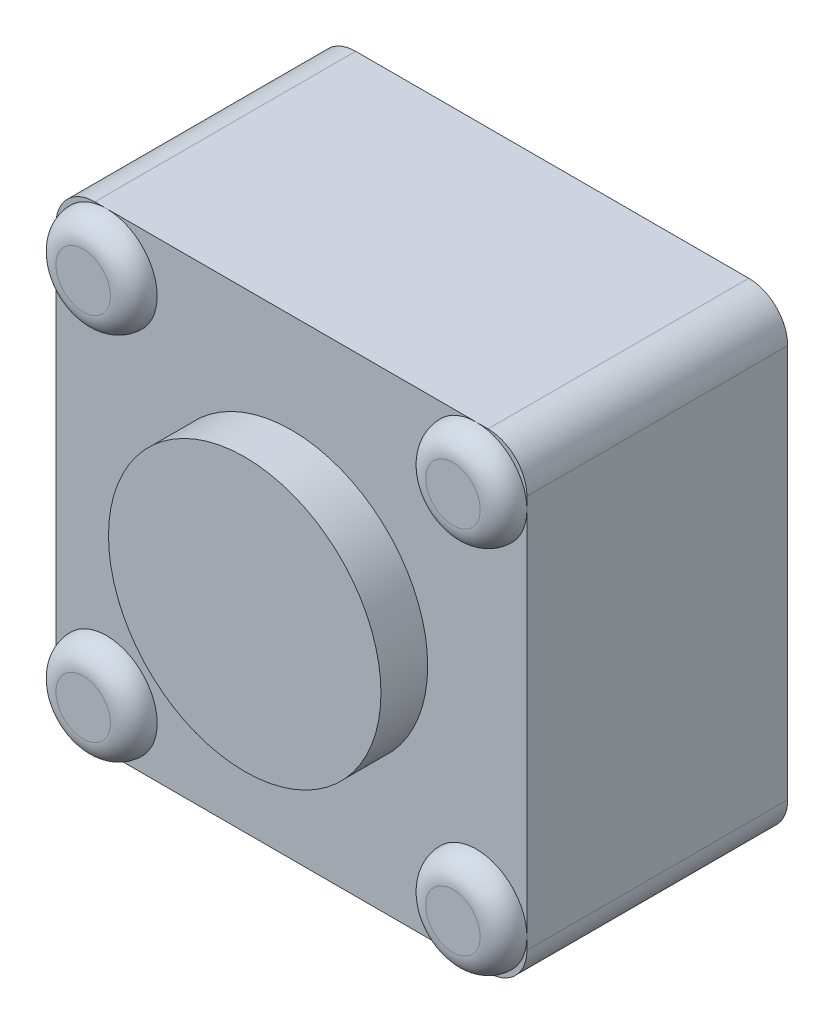
ISO-10303-21;
HEADER;
FILE_DESCRIPTION(('STEP AP214'),'2;1');
FILE_NAME('part.step','',(''),(''),'','','');
FILE_SCHEMA(('AUTOMOTIVE_DESIGN { 1 0 10303 214 1 1 1 1 }'));
ENDSEC;
DATA;
#1=APPLICATION_CONTEXT('core data for automotive mechanical design processes');
#2=APPLICATION_PROTOCOL_DEFINITION('international standard','automotive_design',2000,#1);
#3=PRODUCT_CONTEXT('',#1,'mechanical');
#4=PRODUCT('Part','Part','',(#3));
#5=PRODUCT_RELATED_PRODUCT_CATEGORY('part','',(#4));
#6=PRODUCT_DEFINITION_FORMATION('','',#4);
#7=PRODUCT_DEFINITION_CONTEXT('part definition',#1,'design');
#8=PRODUCT_DEFINITION('design','',#6,#7);
#9=PRODUCT_DEFINITION_SHAPE('','',#8);
#10=(LENGTH_UNIT() NAMED_UNIT(*) SI_UNIT(.MILLI.,.METRE.));
#11=(NAMED_UNIT(*) PLANE_ANGLE_UNIT() SI_UNIT($,.RADIAN.));
#12=(NAMED_UNIT(*) SI_UNIT($,.STERADIAN.) SOLID_ANGLE_UNIT());
#13=UNCERTAINTY_MEASURE_WITH_UNIT(LENGTH_MEASURE(1.E-05),#10,'distance_accuracy_value','');
#14=(GEOMETRIC_REPRESENTATION_CONTEXT(3) GLOBAL_UNCERTAINTY_ASSIGNED_CONTEXT((#13)) GLOBAL_UNIT_ASSIGNED_CONTEXT((#10,
#11,#12)) REPRESENTATION_CONTEXT('',''));
#15=CARTESIAN_POINT('',(0.,0.,0.));
#16=DIRECTION('',(0.,0.,1.));
#17=DIRECTION('',(1.,0.,0.));
#18=AXIS2_PLACEMENT_3D('',#15,#16,#17);
#19=CARTESIAN_POINT('',(-2.375,-2.375,3.65));
#20=DIRECTION('',(0.,0.,1.));
#21=DIRECTION('',(1.,0.,0.));
#22=AXIS2_PLACEMENT_3D('',#19,#20,#21);
#23=PLANE('',#22);
#24=CARTESIAN_POINT('',(-2.375,-2.375,3.65));
#25=DIRECTION('',(0.,0.,-1.));
#26=DIRECTION('',(1.,0.,0.));
#27=AXIS2_PLACEMENT_3D('',#24,#25,#26);
#28=CIRCLE('',#27,0.35);
#29=CARTESIAN_POINT('',(-2.025,-2.375,3.65));
#30=VERTEX_POINT('',#29);
#31=EDGE_CURVE('E257',#30,#30,#28,.T.);
#32=ORIENTED_EDGE('',*,*,#31,.F.);
#33=EDGE_LOOP('',(#32));
#34=FACE_BOUND('',#33,.T.);
#35=ADVANCED_FACE('F16',(#34),#23,.T.);
#36=CARTESIAN_POINT('',(2.375,-2.375,3.65));
#37=DIRECTION('',(0.,0.,1.));
#38=DIRECTION('',(1.,0.,0.));
#39=AXIS2_PLACEMENT_3D('',#36,#37,#38);
#40=PLANE('',#39);
#41=CARTESIAN_POINT('',(2.375,-2.375,3.65));
#42=DIRECTION('',(0.,0.,-1.));
#43=DIRECTION('',(1.,0.,0.));
#44=AXIS2_PLACEMENT_3D('',#41,#42,#43);
#45=CIRCLE('',#44,0.35);
#46=CARTESIAN_POINT('',(2.725,-2.375,3.65));
#47=VERTEX_POINT('',#46);
#48=EDGE_CURVE('E221',#47,#47,#45,.T.);
#49=ORIENTED_EDGE('',*,*,#48,.F.);
#50=EDGE_LOOP('',(#49));
#51=FACE_BOUND('',#50,.T.);
#52=ADVANCED_FACE('F201',(#51),#40,.T.);
#53=CARTESIAN_POINT('',(2.375,2.375,3.65));
#54=DIRECTION('',(0.,0.,1.));
#55=DIRECTION('',(1.,0.,0.));
#56=AXIS2_PLACEMENT_3D('',#53,#54,#55);
#57=PLANE('',#56);
#58=CARTESIAN_POINT('',(2.375,2.375,3.65));
#59=DIRECTION('',(0.,0.,-1.));
#60=DIRECTION('',(1.,0.,0.));
#61=AXIS2_PLACEMENT_3D('',#58,#59,#60);
#62=CIRCLE('',#61,0.35);
#63=CARTESIAN_POINT('',(2.725,2.375,3.65));
#64=VERTEX_POINT('',#63);
#65=EDGE_CURVE('E185',#64,#64,#62,.T.);
#66=ORIENTED_EDGE('',*,*,#65,.F.);
#67=EDGE_LOOP('',(#66));
#68=FACE_BOUND('',#67,.T.);
#69=ADVANCED_FACE('F191',(#68),#57,.T.);
#70=CARTESIAN_POINT('',(-2.375,2.375,3.65));
#71=DIRECTION('',(0.,0.,1.));
#72=DIRECTION('',(1.,0.,0.));
#73=AXIS2_PLACEMENT_3D('',#70,#71,#72);
#74=PLANE('',#73);
#75=CARTESIAN_POINT('',(-2.375,2.375,3.65));
#76=DIRECTION('',(0.,0.,-1.));
#77=DIRECTION('',(1.,0.,0.));
#78=AXIS2_PLACEMENT_3D('',#75,#76,#77);
#79=CIRCLE('',#78,0.35);
#80=CARTESIAN_POINT('',(-2.025,2.375,3.65));
#81=VERTEX_POINT('',#80);
#82=EDGE_CURVE('E243',#81,#81,#79,.T.);
#83=ORIENTED_EDGE('',*,*,#82,.F.);
#84=EDGE_LOOP('',(#83));
#85=FACE_BOUND('',#84,.T.);
#86=ADVANCED_FACE('F200',(#85),#74,.T.);
#87=CARTESIAN_POINT('',(0.,0.,3.95));
#88=DIRECTION('',(0.,0.,1.));
#89=DIRECTION('',(1.,0.,0.));
#90=AXIS2_PLACEMENT_3D('',#87,#88,#89);
#91=PLANE('',#90);
#92=CARTESIAN_POINT('',(0.,0.,3.95));
#93=DIRECTION('',(0.,0.,1.));
#94=DIRECTION('',(1.,0.,0.));
#95=AXIS2_PLACEMENT_3D('',#92,#93,#94);
#96=CIRCLE('',#95,1.75);
#97=CARTESIAN_POINT('',(1.75,0.,3.95));
#98=VERTEX_POINT('',#97);
#99=EDGE_CURVE('E251',#98,#98,#96,.F.);
#100=ORIENTED_EDGE('',*,*,#99,.F.);
#101=EDGE_LOOP('',(#100));
#102=FACE_BOUND('',#101,.T.);
#103=ADVANCED_FACE('F507',(#102),#91,.T.);
#104=CARTESIAN_POINT('',(-2.375,-2.375,3.35));
#105=DIRECTION('',(0.,0.,1.));
#106=DIRECTION('',(1.,0.,0.));
#107=AXIS2_PLACEMENT_3D('',#104,#105,#106);
#108=TOROIDAL_SURFACE('',#107,0.35,0.3);
#109=ORIENTED_EDGE('',*,*,#31,.T.);
#110=EDGE_LOOP('',(#109));
#111=FACE_BOUND('',#110,.T.);
#112=CARTESIAN_POINT('',(-2.375,-2.375,3.35));
#113=DIRECTION('',(0.,0.,1.));
#114=DIRECTION('',(1.,0.,0.));
#115=AXIS2_PLACEMENT_3D('',#112,#113,#114);
#116=CIRCLE('',#115,0.65);
#117=CARTESIAN_POINT('',(-3.025,-2.375,3.35));
#118=VERTEX_POINT('',#117);
#119=CARTESIAN_POINT('',(-2.375,-3.025,3.35));
#120=VERTEX_POINT('',#119);
#121=EDGE_CURVE('E111',#118,#120,#116,.F.);
#122=ORIENTED_EDGE('',*,*,#121,.F.);
#123=CARTESIAN_POINT('',(-2.375,-2.375,3.35));
#124=DIRECTION('',(0.,0.,1.));
#125=DIRECTION('',(1.,0.,0.));
#126=AXIS2_PLACEMENT_3D('',#123,#124,#125);
#127=CIRCLE('',#126,0.65);
#128=EDGE_CURVE('E136',#120,#118,#127,.F.);
#129=ORIENTED_EDGE('',*,*,#128,.F.);
#130=EDGE_LOOP('',(#122,#129));
#131=FACE_BOUND('',#130,.T.);
#132=ADVANCED_FACE('F137',(#111,#131),#108,.T.);
#133=CARTESIAN_POINT('',(2.375,-2.375,3.35));
#134=DIRECTION('',(0.,0.,1.));
#135=DIRECTION('',(1.,0.,0.));
#136=AXIS2_PLACEMENT_3D('',#133,#134,#135);
#137=TOROIDAL_SURFACE('',#136,0.35,0.3);
#138=ORIENTED_EDGE('',*,*,#48,.T.);
#139=EDGE_LOOP('',(#138));
#140=FACE_BOUND('',#139,.T.);
#141=CARTESIAN_POINT('',(2.375,-2.375,3.35));
#142=DIRECTION('',(0.,0.,1.));
#143=DIRECTION('',(1.,0.,0.));
#144=AXIS2_PLACEMENT_3D('',#141,#142,#143);
#145=CIRCLE('',#144,0.65);
#146=CARTESIAN_POINT('',(2.375,-3.025,3.35));
#147=VERTEX_POINT('',#146);
#148=CARTESIAN_POINT('',(3.025,-2.375,3.35));
#149=VERTEX_POINT('',#148);
#150=EDGE_CURVE('E120',#147,#149,#145,.F.);
#151=ORIENTED_EDGE('',*,*,#150,.F.);
#152=CARTESIAN_POINT('',(2.375,-2.375,3.35));
#153=DIRECTION('',(0.,0.,1.));
#154=DIRECTION('',(1.,0.,0.));
#155=AXIS2_PLACEMENT_3D('',#152,#153,#154);
#156=CIRCLE('',#155,0.65);
#157=EDGE_CURVE('E295',#149,#147,#156,.F.);
#158=ORIENTED_EDGE('',*,*,#157,.F.);
#159=EDGE_LOOP('',(#151,#158));
#160=FACE_BOUND('',#159,.T.);
#161=ADVANCED_FACE('F227',(#140,#160),#137,.T.);
#162=CARTESIAN_POINT('',(2.375,2.375,3.35));
#163=DIRECTION('',(0.,0.,1.));
#164=DIRECTION('',(1.,0.,0.));
#165=AXIS2_PLACEMENT_3D('',#162,#163,#164);
#166=TOROIDAL_SURFACE('',#165,0.35,0.3);
#167=ORIENTED_EDGE('',*,*,#65,.T.);
#168=EDGE_LOOP('',(#167));
#169=FACE_BOUND('',#168,.T.);
#170=CARTESIAN_POINT('',(2.375,2.375,3.35));
#171=DIRECTION('',(0.,0.,1.));
#172=DIRECTION('',(1.,0.,0.));
#173=AXIS2_PLACEMENT_3D('',#170,#171,#172);
#174=CIRCLE('',#173,0.65);
#175=CARTESIAN_POINT('',(2.375,3.025,3.35));
#176=VERTEX_POINT('',#175);
#177=CARTESIAN_POINT('',(3.025,2.375,3.35));
#178=VERTEX_POINT('',#177);
#179=EDGE_CURVE('E289',#176,#178,#174,.F.);
#180=ORIENTED_EDGE('',*,*,#179,.F.);
#181=CARTESIAN_POINT('',(2.375,2.375,3.35));
#182=DIRECTION('',(0.,0.,1.));
#183=DIRECTION('',(1.,0.,0.));
#184=AXIS2_PLACEMENT_3D('',#181,#182,#183);
#185=CIRCLE('',#184,0.65);
#186=EDGE_CURVE('E282',#178,#176,#185,.F.);
#187=ORIENTED_EDGE('',*,*,#186,.F.);
#188=EDGE_LOOP('',(#180,#187));
#189=FACE_BOUND('',#188,.T.);
#190=ADVANCED_FACE('F164',(#169,#189),#166,.T.);
#191=CARTESIAN_POINT('',(-2.375,2.375,3.35));
#192=DIRECTION('',(0.,0.,1.));
#193=DIRECTION('',(1.,0.,0.));
#194=AXIS2_PLACEMENT_3D('',#191,#192,#193);
#195=TOROIDAL_SURFACE('',#194,0.35,0.3);
#196=ORIENTED_EDGE('',*,*,#82,.T.);
#197=EDGE_LOOP('',(#196));
#198=FACE_BOUND('',#197,.T.);
#199=CARTESIAN_POINT('',(-2.375,2.375,3.35));
#200=DIRECTION('',(0.,0.,1.));
#201=DIRECTION('',(1.,0.,0.));
#202=AXIS2_PLACEMENT_3D('',#199,#200,#201);
#203=CIRCLE('',#202,0.65);
#204=CARTESIAN_POINT('',(-2.375,3.025,3.35));
#205=VERTEX_POINT('',#204);
#206=CARTESIAN_POINT('',(-3.025,2.375,3.35));
#207=VERTEX_POINT('',#206);
#208=EDGE_CURVE('E280',#205,#207,#203,.F.);
#209=ORIENTED_EDGE('',*,*,#208,.F.);
#210=CARTESIAN_POINT('',(-2.375,2.375,3.35));
#211=DIRECTION('',(0.,0.,1.));
#212=DIRECTION('',(1.,0.,0.));
#213=AXIS2_PLACEMENT_3D('',#210,#211,#212);
#214=CIRCLE('',#213,0.65);
#215=EDGE_CURVE('E20',#205,#207,#214,.T.);
#216=ORIENTED_EDGE('',*,*,#215,.T.);
#217=EDGE_LOOP('',(#209,#216));
#218=FACE_BOUND('',#217,.T.);
#219=ADVANCED_FACE('F158',(#198,#218),#195,.T.);
#220=CARTESIAN_POINT('',(0.,0.,3.35));
#221=DIRECTION('',(0.,0.,1.));
#222=DIRECTION('',(1.,0.,0.));
#223=AXIS2_PLACEMENT_3D('',#220,#221,#222);
#224=CYLINDRICAL_SURFACE('',#223,1.75);
#225=CARTESIAN_POINT('',(0.,0.,3.35));
#226=DIRECTION('',(0.,0.,1.));
#227=DIRECTION('',(1.,0.,0.));
#228=AXIS2_PLACEMENT_3D('',#225,#226,#227);
#229=CIRCLE('',#228,1.75);
#230=CARTESIAN_POINT('',(1.75,0.,3.35));
#231=VERTEX_POINT('',#230);
#232=EDGE_CURVE('E277',#231,#231,#229,.F.);
#233=ORIENTED_EDGE('',*,*,#232,.F.);
#234=EDGE_LOOP('',(#233));
#235=FACE_BOUND('',#234,.T.);
#236=ORIENTED_EDGE('',*,*,#99,.T.);
#237=EDGE_LOOP('',(#236));
#238=FACE_BOUND('',#237,.T.);
#239=ADVANCED_FACE('F163',(#235,#238),#224,.T.);
#240=CARTESIAN_POINT('',(2.525,-2.525,0.));
#241=DIRECTION('',(0.,0.,1.));
#242=DIRECTION('',(1.,0.,0.));
#243=AXIS2_PLACEMENT_3D('',#240,#241,#242);
#244=CYLINDRICAL_SURFACE('',#243,0.5);
#245=CARTESIAN_POINT('',(2.525,-2.525,0.));
#246=DIRECTION('',(0.,0.,1.));
#247=DIRECTION('',(1.,0.,0.));
#248=AXIS2_PLACEMENT_3D('',#245,#246,#247);
#249=CIRCLE('',#248,0.5);
#250=CARTESIAN_POINT('',(2.525,-3.025,0.));
#251=VERTEX_POINT('',#250);
#252=CARTESIAN_POINT('',(3.025,-2.525,0.));
#253=VERTEX_POINT('',#252);
#254=EDGE_CURVE('E253',#251,#253,#249,.T.);
#255=ORIENTED_EDGE('',*,*,#254,.T.);
#256=DIRECTION('',(0.,0.,-1.));
#257=VECTOR('',#256,1.);
#258=CARTESIAN_POINT('',(3.025,-2.525,0.));
#259=LINE('',#258,#257);
#260=CARTESIAN_POINT('',(3.025,-2.525,3.35));
#261=VERTEX_POINT('',#260);
#262=EDGE_CURVE('E144',#261,#253,#259,.T.);
#263=ORIENTED_EDGE('',*,*,#262,.F.);
#264=CARTESIAN_POINT('',(2.525,-2.525,3.35));
#265=DIRECTION('',(0.,0.,1.));
#266=DIRECTION('',(1.,0.,0.));
#267=AXIS2_PLACEMENT_3D('',#264,#265,#266);
#268=CIRCLE('',#267,0.5);
#269=CARTESIAN_POINT('',(2.525,-3.025,3.35));
#270=VERTEX_POINT('',#269);
#271=EDGE_CURVE('E293',#270,#261,#268,.T.);
#272=ORIENTED_EDGE('',*,*,#271,.F.);
#273=DIRECTION('',(0.,0.,-1.));
#274=VECTOR('',#273,1.);
#275=CARTESIAN_POINT('',(2.525,-3.025,0.));
#276=LINE('',#275,#274);
#277=EDGE_CURVE('E152',#251,#270,#276,.F.);
#278=ORIENTED_EDGE('',*,*,#277,.F.);
#279=EDGE_LOOP('',(#255,#263,#272,#278));
#280=FACE_BOUND('',#279,.T.);
#281=ADVANCED_FACE('F300',(#280),#244,.T.);
#282=CARTESIAN_POINT('',(0.,0.,3.35));
#283=DIRECTION('',(0.,0.,1.));
#284=DIRECTION('',(1.,0.,0.));
#285=AXIS2_PLACEMENT_3D('',#282,#283,#284);
#286=PLANE('',#285);
#287=ORIENTED_EDGE('',*,*,#271,.T.);
#288=DIRECTION('',(0.,1.,0.));
#289=VECTOR('',#288,1.);
#290=CARTESIAN_POINT('',(3.025,-3.025,3.35));
#291=LINE('',#290,#289);
#292=EDGE_CURVE('E311',#149,#261,#291,.F.);
#293=ORIENTED_EDGE('',*,*,#292,.F.);
#294=ORIENTED_EDGE('',*,*,#157,.T.);
#295=DIRECTION('',(1.,0.,0.));
#296=VECTOR('',#295,1.);
#297=CARTESIAN_POINT('',(-3.025,-3.025,3.35));
#298=LINE('',#297,#296);
#299=EDGE_CURVE('E132',#270,#147,#298,.F.);
#300=ORIENTED_EDGE('',*,*,#299,.F.);
#301=EDGE_LOOP('',(#287,#293,#294,#300));
#302=FACE_BOUND('',#301,.T.);
#303=ADVANCED_FACE('F364',(#302),#286,.T.);
#304=CARTESIAN_POINT('',(2.525,2.525,0.));
#305=DIRECTION('',(0.,0.,1.));
#306=DIRECTION('',(1.,0.,0.));
#307=AXIS2_PLACEMENT_3D('',#304,#305,#306);
#308=CYLINDRICAL_SURFACE('',#307,0.5);
#309=CARTESIAN_POINT('',(2.525,2.525,0.));
#310=DIRECTION('',(0.,0.,1.));
#311=DIRECTION('',(1.,0.,0.));
#312=AXIS2_PLACEMENT_3D('',#309,#310,#311);
#313=CIRCLE('',#312,0.5);
#314=CARTESIAN_POINT('',(3.025,2.525,0.));
#315=VERTEX_POINT('',#314);
#316=CARTESIAN_POINT('',(2.525,3.025,0.));
#317=VERTEX_POINT('',#316);
#318=EDGE_CURVE('E291',#315,#317,#313,.T.);
#319=ORIENTED_EDGE('',*,*,#318,.T.);
#320=DIRECTION('',(0.,0.,1.));
#321=VECTOR('',#320,1.);
#322=CARTESIAN_POINT('',(2.525,3.025,0.));
#323=LINE('',#322,#321);
#324=CARTESIAN_POINT('',(2.525,3.025,3.35));
#325=VERTEX_POINT('',#324);
#326=EDGE_CURVE('E329',#325,#317,#323,.F.);
#327=ORIENTED_EDGE('',*,*,#326,.F.);
#328=CARTESIAN_POINT('',(2.525,2.525,3.35));
#329=DIRECTION('',(0.,0.,1.));
#330=DIRECTION('',(1.,0.,0.));
#331=AXIS2_PLACEMENT_3D('',#328,#329,#330);
#332=CIRCLE('',#331,0.5);
#333=CARTESIAN_POINT('',(3.025,2.525,3.35));
#334=VERTEX_POINT('',#333);
#335=EDGE_CURVE('E287',#334,#325,#332,.T.);
#336=ORIENTED_EDGE('',*,*,#335,.F.);
#337=DIRECTION('',(0.,0.,-1.));
#338=VECTOR('',#337,1.);
#339=CARTESIAN_POINT('',(3.025,2.525,0.));
#340=LINE('',#339,#338);
#341=EDGE_CURVE('E147',#315,#334,#340,.F.);
#342=ORIENTED_EDGE('',*,*,#341,.F.);
#343=EDGE_LOOP('',(#319,#327,#336,#342));
#344=FACE_BOUND('',#343,.T.);
#345=ADVANCED_FACE('F366',(#344),#308,.T.);
#346=CARTESIAN_POINT('',(0.,0.,3.35));
#347=DIRECTION('',(0.,0.,1.));
#348=DIRECTION('',(1.,0.,0.));
#349=AXIS2_PLACEMENT_3D('',#346,#347,#348);
#350=PLANE('',#349);
#351=ORIENTED_EDGE('',*,*,#335,.T.);
#352=DIRECTION('',(1.,0.,0.));
#353=VECTOR('',#352,1.);
#354=CARTESIAN_POINT('',(3.025,3.025,3.35));
#355=LINE('',#354,#353);
#356=EDGE_CURVE('E328',#176,#325,#355,.T.);
#357=ORIENTED_EDGE('',*,*,#356,.F.);
#358=ORIENTED_EDGE('',*,*,#179,.T.);
#359=DIRECTION('',(0.,1.,0.));
#360=VECTOR('',#359,1.);
#361=CARTESIAN_POINT('',(3.025,-3.025,3.35));
#362=LINE('',#361,#360);
#363=EDGE_CURVE('E336',#334,#178,#362,.F.);
#364=ORIENTED_EDGE('',*,*,#363,.F.);
#365=EDGE_LOOP('',(#351,#357,#358,#364));
#366=FACE_BOUND('',#365,.T.);
#367=ADVANCED_FACE('F373',(#366),#350,.T.);
#368=CARTESIAN_POINT('',(-2.525,-2.525,0.));
#369=DIRECTION('',(0.,0.,1.));
#370=DIRECTION('',(1.,0.,0.));
#371=AXIS2_PLACEMENT_3D('',#368,#369,#370);
#372=CYLINDRICAL_SURFACE('',#371,0.5);
#373=CARTESIAN_POINT('',(-2.525,-2.525,0.));
#374=DIRECTION('',(0.,0.,1.));
#375=DIRECTION('',(1.,0.,0.));
#376=AXIS2_PLACEMENT_3D('',#373,#374,#375);
#377=CIRCLE('',#376,0.5);
#378=CARTESIAN_POINT('',(-3.025,-2.525,0.));
#379=VERTEX_POINT('',#378);
#380=CARTESIAN_POINT('',(-2.525,-3.025,0.));
#381=VERTEX_POINT('',#380);
#382=EDGE_CURVE('E35',#379,#381,#377,.T.);
#383=ORIENTED_EDGE('',*,*,#382,.T.);
#384=DIRECTION('',(0.,0.,-1.));
#385=VECTOR('',#384,1.);
#386=CARTESIAN_POINT('',(-2.525,-3.025,0.));
#387=LINE('',#386,#385);
#388=CARTESIAN_POINT('',(-2.525,-3.025,3.35));
#389=VERTEX_POINT('',#388);
#390=EDGE_CURVE('E275',#389,#381,#387,.T.);
#391=ORIENTED_EDGE('',*,*,#390,.F.);
#392=CARTESIAN_POINT('',(-2.525,-2.525,3.35));
#393=DIRECTION('',(0.,0.,1.));
#394=DIRECTION('',(1.,0.,0.));
#395=AXIS2_PLACEMENT_3D('',#392,#393,#394);
#396=CIRCLE('',#395,0.5);
#397=CARTESIAN_POINT('',(-3.025,-2.525,3.35));
#398=VERTEX_POINT('',#397);
#399=EDGE_CURVE('E121',#398,#389,#396,.T.);
#400=ORIENTED_EDGE('',*,*,#399,.F.);
#401=DIRECTION('',(0.,0.,1.));
#402=VECTOR('',#401,1.);
#403=CARTESIAN_POINT('',(-3.025,-2.525,0.));
#404=LINE('',#403,#402);
#405=EDGE_CURVE('E325',#379,#398,#404,.T.);
#406=ORIENTED_EDGE('',*,*,#405,.F.);
#407=EDGE_LOOP('',(#383,#391,#400,#406));
#408=FACE_BOUND('',#407,.T.);
#409=ADVANCED_FACE('F404',(#408),#372,.T.);
#410=CARTESIAN_POINT('',(0.,0.,3.35));
#411=DIRECTION('',(0.,0.,1.));
#412=DIRECTION('',(1.,0.,0.));
#413=AXIS2_PLACEMENT_3D('',#410,#411,#412);
#414=PLANE('',#413);
#415=ORIENTED_EDGE('',*,*,#399,.T.);
#416=DIRECTION('',(1.,0.,0.));
#417=VECTOR('',#416,1.);
#418=CARTESIAN_POINT('',(-3.025,-3.025,3.35));
#419=LINE('',#418,#417);
#420=EDGE_CURVE('E129',#120,#389,#419,.F.);
#421=ORIENTED_EDGE('',*,*,#420,.F.);
#422=ORIENTED_EDGE('',*,*,#128,.T.);
#423=DIRECTION('',(0.,1.,0.));
#424=VECTOR('',#423,1.);
#425=CARTESIAN_POINT('',(-3.025,3.025,3.35));
#426=LINE('',#425,#424);
#427=EDGE_CURVE('E327',#398,#118,#426,.T.);
#428=ORIENTED_EDGE('',*,*,#427,.F.);
#429=EDGE_LOOP('',(#415,#421,#422,#428));
#430=FACE_BOUND('',#429,.T.);
#431=ADVANCED_FACE('F142',(#430),#414,.T.);
#432=CARTESIAN_POINT('',(0.,0.,3.35));
#433=DIRECTION('',(0.,0.,1.));
#434=DIRECTION('',(1.,0.,0.));
#435=AXIS2_PLACEMENT_3D('',#432,#433,#434);
#436=PLANE('',#435);
#437=ORIENTED_EDGE('',*,*,#232,.T.);
#438=EDGE_LOOP('',(#437));
#439=FACE_BOUND('',#438,.T.);
#440=ORIENTED_EDGE('',*,*,#208,.T.);
#441=DIRECTION('',(0.,1.,0.));
#442=VECTOR('',#441,1.);
#443=CARTESIAN_POINT('',(-3.025,3.025,3.35));
#444=LINE('',#443,#442);
#445=EDGE_CURVE('E117',#118,#207,#444,.T.);
#446=ORIENTED_EDGE('',*,*,#445,.F.);
#447=ORIENTED_EDGE('',*,*,#121,.T.);
#448=DIRECTION('',(1.,0.,0.));
#449=VECTOR('',#448,1.);
#450=CARTESIAN_POINT('',(-3.025,-3.025,3.35));
#451=LINE('',#450,#449);
#452=EDGE_CURVE('E115',#147,#120,#451,.F.);
#453=ORIENTED_EDGE('',*,*,#452,.F.);
#454=ORIENTED_EDGE('',*,*,#150,.T.);
#455=DIRECTION('',(0.,1.,0.));
#456=VECTOR('',#455,1.);
#457=CARTESIAN_POINT('',(3.025,-3.025,3.35));
#458=LINE('',#457,#456);
#459=EDGE_CURVE('E349',#178,#149,#458,.F.);
#460=ORIENTED_EDGE('',*,*,#459,.F.);
#461=ORIENTED_EDGE('',*,*,#186,.T.);
#462=DIRECTION('',(1.,0.,0.));
#463=VECTOR('',#462,1.);
#464=CARTESIAN_POINT('',(3.025,3.025,3.35));
#465=LINE('',#464,#463);
#466=EDGE_CURVE('E343',#205,#176,#465,.T.);
#467=ORIENTED_EDGE('',*,*,#466,.F.);
#468=EDGE_LOOP('',(#440,#446,#447,#453,#454,#460,#461,#467));
#469=FACE_BOUND('',#468,.T.);
#470=ADVANCED_FACE('F114',(#439,#469),#436,.T.);
#471=CARTESIAN_POINT('',(0.,0.,3.35));
#472=DIRECTION('',(0.,0.,1.));
#473=DIRECTION('',(1.,0.,0.));
#474=AXIS2_PLACEMENT_3D('',#471,#472,#473);
#475=PLANE('',#474);
#476=CARTESIAN_POINT('',(-2.525,2.525,3.35));
#477=DIRECTION('',(0.,0.,1.));
#478=DIRECTION('',(1.,0.,0.));
#479=AXIS2_PLACEMENT_3D('',#476,#477,#478);
#480=CIRCLE('',#479,0.5);
#481=CARTESIAN_POINT('',(-3.025,2.525,3.35));
#482=VERTEX_POINT('',#481);
#483=CARTESIAN_POINT('',(-2.525,3.025,3.35));
#484=VERTEX_POINT('',#483);
#485=EDGE_CURVE('E99',#482,#484,#480,.F.);
#486=ORIENTED_EDGE('',*,*,#485,.F.);
#487=DIRECTION('',(0.,1.,0.));
#488=VECTOR('',#487,1.);
#489=CARTESIAN_POINT('',(-3.025,3.025,3.35));
#490=LINE('',#489,#488);
#491=EDGE_CURVE('E324',#207,#482,#490,.T.);
#492=ORIENTED_EDGE('',*,*,#491,.F.);
#493=ORIENTED_EDGE('',*,*,#215,.F.);
#494=DIRECTION('',(1.,0.,0.));
#495=VECTOR('',#494,1.);
#496=CARTESIAN_POINT('',(3.025,3.025,3.35));
#497=LINE('',#496,#495);
#498=EDGE_CURVE('E333',#484,#205,#497,.T.);
#499=ORIENTED_EDGE('',*,*,#498,.F.);
#500=EDGE_LOOP('',(#486,#492,#493,#499));
#501=FACE_BOUND('',#500,.T.);
#502=ADVANCED_FACE('F396',(#501),#475,.T.);
#503=CARTESIAN_POINT('',(-2.525,2.525,0.));
#504=DIRECTION('',(0.,0.,1.));
#505=DIRECTION('',(1.,0.,0.));
#506=AXIS2_PLACEMENT_3D('',#503,#504,#505);
#507=CYLINDRICAL_SURFACE('',#506,0.5);
#508=CARTESIAN_POINT('',(-2.525,2.525,0.));
#509=DIRECTION('',(0.,0.,1.));
#510=DIRECTION('',(1.,0.,0.));
#511=AXIS2_PLACEMENT_3D('',#508,#509,#510);
#512=CIRCLE('',#511,0.5);
#513=CARTESIAN_POINT('',(-2.525,3.025,0.));
#514=VERTEX_POINT('',#513);
#515=CARTESIAN_POINT('',(-3.025,2.525,0.));
#516=VERTEX_POINT('',#515);
#517=EDGE_CURVE('E268',#514,#516,#512,.T.);
#518=ORIENTED_EDGE('',*,*,#517,.T.);
#519=DIRECTION('',(0.,0.,1.));
#520=VECTOR('',#519,1.);
#521=CARTESIAN_POINT('',(-3.025,2.525,0.));
#522=LINE('',#521,#520);
#523=EDGE_CURVE('E319',#482,#516,#522,.F.);
#524=ORIENTED_EDGE('',*,*,#523,.F.);
#525=ORIENTED_EDGE('',*,*,#485,.T.);
#526=DIRECTION('',(0.,0.,1.));
#527=VECTOR('',#526,1.);
#528=CARTESIAN_POINT('',(-2.525,3.025,0.));
#529=LINE('',#528,#527);
#530=EDGE_CURVE('E332',#514,#484,#529,.T.);
#531=ORIENTED_EDGE('',*,*,#530,.F.);
#532=EDGE_LOOP('',(#518,#524,#525,#531));
#533=FACE_BOUND('',#532,.T.);
#534=ADVANCED_FACE('F393',(#533),#507,.T.);
#535=CARTESIAN_POINT('',(-3.025,-3.025,0.));
#536=DIRECTION('',(0.,-1.,0.));
#537=DIRECTION('',(0.,0.,-1.));
#538=AXIS2_PLACEMENT_3D('',#535,#536,#537);
#539=PLANE('',#538);
#540=ORIENTED_EDGE('',*,*,#452,.T.);
#541=ORIENTED_EDGE('',*,*,#420,.T.);
#542=ORIENTED_EDGE('',*,*,#390,.T.);
#543=DIRECTION('',(1.,0.,0.));
#544=VECTOR('',#543,1.);
#545=CARTESIAN_POINT('',(0.,-3.025,0.));
#546=LINE('',#545,#544);
#547=EDGE_CURVE('E315',#381,#251,#546,.T.);
#548=ORIENTED_EDGE('',*,*,#547,.T.);
#549=ORIENTED_EDGE('',*,*,#277,.T.);
#550=ORIENTED_EDGE('',*,*,#299,.T.);
#551=EDGE_LOOP('',(#540,#541,#542,#548,#549,#550));
#552=FACE_BOUND('',#551,.T.);
#553=ADVANCED_FACE('F126',(#552),#539,.T.);
#554=CARTESIAN_POINT('',(3.025,-3.025,0.));
#555=DIRECTION('',(1.,0.,0.));
#556=DIRECTION('',(0.,0.,-1.));
#557=AXIS2_PLACEMENT_3D('',#554,#555,#556);
#558=PLANE('',#557);
#559=ORIENTED_EDGE('',*,*,#459,.T.);
#560=ORIENTED_EDGE('',*,*,#292,.T.);
#561=ORIENTED_EDGE('',*,*,#262,.T.);
#562=DIRECTION('',(0.,1.,0.));
#563=VECTOR('',#562,1.);
#564=CARTESIAN_POINT('',(3.025,0.,0.));
#565=LINE('',#564,#563);
#566=EDGE_CURVE('E309',#253,#315,#565,.T.);
#567=ORIENTED_EDGE('',*,*,#566,.T.);
#568=ORIENTED_EDGE('',*,*,#341,.T.);
#569=ORIENTED_EDGE('',*,*,#363,.T.);
#570=EDGE_LOOP('',(#559,#560,#561,#567,#568,#569));
#571=FACE_BOUND('',#570,.T.);
#572=ADVANCED_FACE('F308',(#571),#558,.T.);
#573=CARTESIAN_POINT('',(3.025,3.025,0.));
#574=DIRECTION('',(0.,1.,0.));
#575=DIRECTION('',(0.,0.,1.));
#576=AXIS2_PLACEMENT_3D('',#573,#574,#575);
#577=PLANE('',#576);
#578=ORIENTED_EDGE('',*,*,#466,.T.);
#579=ORIENTED_EDGE('',*,*,#356,.T.);
#580=ORIENTED_EDGE('',*,*,#326,.T.);
#581=DIRECTION('',(1.,0.,0.));
#582=VECTOR('',#581,1.);
#583=CARTESIAN_POINT('',(0.,3.025,0.));
#584=LINE('',#583,#582);
#585=EDGE_CURVE('E26',#317,#514,#584,.F.);
#586=ORIENTED_EDGE('',*,*,#585,.T.);
#587=ORIENTED_EDGE('',*,*,#530,.T.);
#588=ORIENTED_EDGE('',*,*,#498,.T.);
#589=EDGE_LOOP('',(#578,#579,#580,#586,#587,#588));
#590=FACE_BOUND('',#589,.T.);
#591=ADVANCED_FACE('F382',(#590),#577,.T.);
#592=CARTESIAN_POINT('',(-3.025,3.025,0.));
#593=DIRECTION('',(-1.,0.,0.));
#594=DIRECTION('',(0.,0.,1.));
#595=AXIS2_PLACEMENT_3D('',#592,#593,#594);
#596=PLANE('',#595);
#597=ORIENTED_EDGE('',*,*,#523,.T.);
#598=DIRECTION('',(0.,1.,0.));
#599=VECTOR('',#598,1.);
#600=CARTESIAN_POINT('',(-3.025,0.,0.));
#601=LINE('',#600,#599);
#602=EDGE_CURVE('E11',#516,#379,#601,.F.);
#603=ORIENTED_EDGE('',*,*,#602,.T.);
#604=ORIENTED_EDGE('',*,*,#405,.T.);
#605=ORIENTED_EDGE('',*,*,#427,.T.);
#606=ORIENTED_EDGE('',*,*,#445,.T.);
#607=ORIENTED_EDGE('',*,*,#491,.T.);
#608=EDGE_LOOP('',(#597,#603,#604,#605,#606,#607));
#609=FACE_BOUND('',#608,.T.);
#610=ADVANCED_FACE('F377',(#609),#596,.T.);
#611=CARTESIAN_POINT('',(0.,0.,0.));
#612=DIRECTION('',(0.,0.,1.));
#613=DIRECTION('',(1.,0.,0.));
#614=AXIS2_PLACEMENT_3D('',#611,#612,#613);
#615=PLANE('',#614);
#616=ORIENTED_EDGE('',*,*,#602,.F.);
#617=ORIENTED_EDGE('',*,*,#517,.F.);
#618=ORIENTED_EDGE('',*,*,#585,.F.);
#619=ORIENTED_EDGE('',*,*,#318,.F.);
#620=ORIENTED_EDGE('',*,*,#566,.F.);
#621=ORIENTED_EDGE('',*,*,#254,.F.);
#622=ORIENTED_EDGE('',*,*,#547,.F.);
#623=ORIENTED_EDGE('',*,*,#382,.F.);
#624=EDGE_LOOP('',(#616,#617,#618,#619,#620,#621,#622,#623));
#625=FACE_BOUND('',#624,.T.);
#626=ADVANCED_FACE('F312',(#625),#615,.F.);
#627=CLOSED_SHELL('',(#35,#52,#69,#86,#103,#132,#161,#190,#219,#239,#281,#303,#345,#367,#409,
#431,#470,#502,#534,#553,#572,#591,#610,#626));
#628=MANIFOLD_SOLID_BREP('B1',#627);
#629=ADVANCED_BREP_SHAPE_REPRESENTATION('',(#18,#628),#14);
#630=SHAPE_DEFINITION_REPRESENTATION(#9,#629);
ENDSEC;
END-ISO-10303-21;
